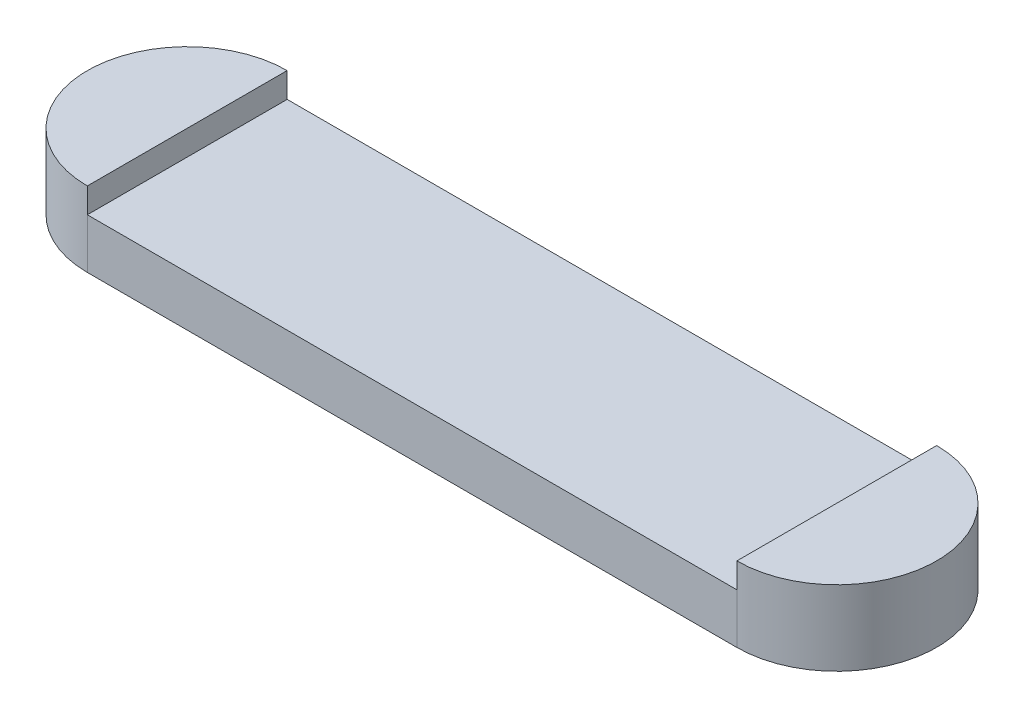
ISO-10303-21;
HEADER;
FILE_DESCRIPTION(('STEP AP214'),'2;1');
FILE_NAME('part.step','',(''),(''),'','','');
FILE_SCHEMA(('AUTOMOTIVE_DESIGN { 1 0 10303 214 1 1 1 1 }'));
ENDSEC;
DATA;
#1=APPLICATION_CONTEXT('core data for automotive mechanical design processes');
#2=APPLICATION_PROTOCOL_DEFINITION('international standard','automotive_design',2000,#1);
#3=PRODUCT_CONTEXT('',#1,'mechanical');
#4=PRODUCT('Part','Part','',(#3));
#5=PRODUCT_RELATED_PRODUCT_CATEGORY('part','',(#4));
#6=PRODUCT_DEFINITION_FORMATION('','',#4);
#7=PRODUCT_DEFINITION_CONTEXT('part definition',#1,'design');
#8=PRODUCT_DEFINITION('design','',#6,#7);
#9=PRODUCT_DEFINITION_SHAPE('','',#8);
#10=(LENGTH_UNIT() NAMED_UNIT(*) SI_UNIT(.MILLI.,.METRE.));
#11=(NAMED_UNIT(*) PLANE_ANGLE_UNIT() SI_UNIT($,.RADIAN.));
#12=(NAMED_UNIT(*) SI_UNIT($,.STERADIAN.) SOLID_ANGLE_UNIT());
#13=UNCERTAINTY_MEASURE_WITH_UNIT(LENGTH_MEASURE(1.E-05),#10,'distance_accuracy_value','');
#14=(GEOMETRIC_REPRESENTATION_CONTEXT(3) GLOBAL_UNCERTAINTY_ASSIGNED_CONTEXT((#13)) GLOBAL_UNIT_ASSIGNED_CONTEXT((#10,
#11,#12)) REPRESENTATION_CONTEXT('',''));
#15=CARTESIAN_POINT('',(0.,0.,0.));
#16=DIRECTION('',(0.,0.,1.));
#17=DIRECTION('',(1.,0.,0.));
#18=AXIS2_PLACEMENT_3D('',#15,#16,#17);
#19=CARTESIAN_POINT('',(0.,2.,0.));
#20=DIRECTION('',(0.,1.,0.));
#21=DIRECTION('',(0.,0.,1.));
#22=AXIS2_PLACEMENT_3D('',#19,#20,#21);
#23=PLANE('',#22);
#24=DIRECTION('',(1.,0.,0.));
#25=VECTOR('',#24,1.);
#26=CARTESIAN_POINT('',(0.,2.,4.));
#27=LINE('',#26,#25);
#28=CARTESIAN_POINT('',(-26.,2.,4.));
#29=VERTEX_POINT('',#28);
#30=CARTESIAN_POINT('',(0.,2.,4.));
#31=VERTEX_POINT('',#30);
#32=EDGE_CURVE('E101',#29,#31,#27,.T.);
#33=ORIENTED_EDGE('',*,*,#32,.T.);
#34=DIRECTION('',(0.,0.,1.));
#35=VECTOR('',#34,1.);
#36=CARTESIAN_POINT('',(0.,2.,-4.));
#37=LINE('',#36,#35);
#38=CARTESIAN_POINT('',(0.,2.,-4.));
#39=VERTEX_POINT('',#38);
#40=EDGE_CURVE('E134',#39,#31,#37,.T.);
#41=ORIENTED_EDGE('',*,*,#40,.F.);
#42=DIRECTION('',(-1.,0.,0.));
#43=VECTOR('',#42,1.);
#44=CARTESIAN_POINT('',(0.,2.,-4.));
#45=LINE('',#44,#43);
#46=CARTESIAN_POINT('',(-26.,2.,-4.));
#47=VERTEX_POINT('',#46);
#48=EDGE_CURVE('E90',#39,#47,#45,.T.);
#49=ORIENTED_EDGE('',*,*,#48,.T.);
#50=DIRECTION('',(0.,0.,-1.));
#51=VECTOR('',#50,1.);
#52=CARTESIAN_POINT('',(-26.,2.,-4.));
#53=LINE('',#52,#51);
#54=EDGE_CURVE('E57',#29,#47,#53,.T.);
#55=ORIENTED_EDGE('',*,*,#54,.F.);
#56=EDGE_LOOP('',(#33,#41,#49,#55));
#57=FACE_BOUND('',#56,.T.);
#58=ADVANCED_FACE('F39',(#57),#23,.T.);
#59=CARTESIAN_POINT('',(0.,2.,0.));
#60=DIRECTION('',(0.,-1.,0.));
#61=DIRECTION('',(0.,0.,-1.));
#62=AXIS2_PLACEMENT_3D('',#59,#60,#61);
#63=CYLINDRICAL_SURFACE('',#62,4.);
#64=CARTESIAN_POINT('',(0.,0.,0.));
#65=DIRECTION('',(0.,1.,0.));
#66=DIRECTION('',(0.,0.,1.));
#67=AXIS2_PLACEMENT_3D('',#64,#65,#66);
#68=CIRCLE('',#67,4.);
#69=CARTESIAN_POINT('',(0.,0.,4.));
#70=VERTEX_POINT('',#69);
#71=CARTESIAN_POINT('',(0.,0.,-4.));
#72=VERTEX_POINT('',#71);
#73=EDGE_CURVE('E96',#70,#72,#68,.T.);
#74=ORIENTED_EDGE('',*,*,#73,.T.);
#75=DIRECTION('',(0.,-1.,0.));
#76=VECTOR('',#75,1.);
#77=CARTESIAN_POINT('',(0.,2.,-4.));
#78=LINE('',#77,#76);
#79=EDGE_CURVE('E11',#39,#72,#78,.T.);
#80=ORIENTED_EDGE('',*,*,#79,.F.);
#81=DIRECTION('',(0.,-1.,0.));
#82=VECTOR('',#81,1.);
#83=CARTESIAN_POINT('',(0.,3.,-4.));
#84=LINE('',#83,#82);
#85=CARTESIAN_POINT('',(0.,3.,-4.));
#86=VERTEX_POINT('',#85);
#87=EDGE_CURVE('E142',#86,#39,#84,.T.);
#88=ORIENTED_EDGE('',*,*,#87,.F.);
#89=CARTESIAN_POINT('',(0.,3.,0.));
#90=DIRECTION('',(0.,1.,0.));
#91=DIRECTION('',(0.,0.,-1.));
#92=AXIS2_PLACEMENT_3D('',#89,#90,#91);
#93=CIRCLE('',#92,4.);
#94=CARTESIAN_POINT('',(0.,3.,4.));
#95=VERTEX_POINT('',#94);
#96=EDGE_CURVE('E172',#95,#86,#93,.T.);
#97=ORIENTED_EDGE('',*,*,#96,.F.);
#98=DIRECTION('',(0.,-1.,0.));
#99=VECTOR('',#98,1.);
#100=CARTESIAN_POINT('',(0.,3.,4.));
#101=LINE('',#100,#99);
#102=EDGE_CURVE('E99',#95,#31,#101,.T.);
#103=ORIENTED_EDGE('',*,*,#102,.T.);
#104=DIRECTION('',(0.,-1.,0.));
#105=VECTOR('',#104,1.);
#106=CARTESIAN_POINT('',(0.,2.,4.));
#107=LINE('',#106,#105);
#108=EDGE_CURVE('E85',#31,#70,#107,.T.);
#109=ORIENTED_EDGE('',*,*,#108,.T.);
#110=EDGE_LOOP('',(#74,#80,#88,#97,#103,#109));
#111=FACE_BOUND('',#110,.T.);
#112=ADVANCED_FACE('F41',(#111),#63,.T.);
#113=CARTESIAN_POINT('',(0.,2.,-4.));
#114=DIRECTION('',(0.,0.,1.));
#115=DIRECTION('',(1.,0.,0.));
#116=AXIS2_PLACEMENT_3D('',#113,#114,#115);
#117=PLANE('',#116);
#118=DIRECTION('',(-1.,0.,0.));
#119=VECTOR('',#118,1.);
#120=CARTESIAN_POINT('',(0.,0.,-4.));
#121=LINE('',#120,#119);
#122=CARTESIAN_POINT('',(-26.,0.,-4.));
#123=VERTEX_POINT('',#122);
#124=EDGE_CURVE('E104',#72,#123,#121,.T.);
#125=ORIENTED_EDGE('',*,*,#124,.T.);
#126=DIRECTION('',(0.,-1.,0.));
#127=VECTOR('',#126,1.);
#128=CARTESIAN_POINT('',(-26.,2.,-4.));
#129=LINE('',#128,#127);
#130=EDGE_CURVE('E49',#47,#123,#129,.T.);
#131=ORIENTED_EDGE('',*,*,#130,.F.);
#132=ORIENTED_EDGE('',*,*,#48,.F.);
#133=ORIENTED_EDGE('',*,*,#79,.T.);
#134=EDGE_LOOP('',(#125,#131,#132,#133));
#135=FACE_BOUND('',#134,.T.);
#136=ADVANCED_FACE('F129',(#135),#117,.F.);
#137=CARTESIAN_POINT('',(-26.,2.,0.));
#138=DIRECTION('',(0.,-1.,0.));
#139=DIRECTION('',(0.,0.,-1.));
#140=AXIS2_PLACEMENT_3D('',#137,#138,#139);
#141=CYLINDRICAL_SURFACE('',#140,4.);
#142=CARTESIAN_POINT('',(-26.,0.,0.));
#143=DIRECTION('',(0.,1.,0.));
#144=DIRECTION('',(0.,0.,1.));
#145=AXIS2_PLACEMENT_3D('',#142,#143,#144);
#146=CIRCLE('',#145,4.);
#147=CARTESIAN_POINT('',(-26.,0.,4.));
#148=VERTEX_POINT('',#147);
#149=EDGE_CURVE('E74',#123,#148,#146,.T.);
#150=ORIENTED_EDGE('',*,*,#149,.T.);
#151=DIRECTION('',(0.,-1.,0.));
#152=VECTOR('',#151,1.);
#153=CARTESIAN_POINT('',(-26.,2.,4.));
#154=LINE('',#153,#152);
#155=EDGE_CURVE('E86',#29,#148,#154,.T.);
#156=ORIENTED_EDGE('',*,*,#155,.F.);
#157=DIRECTION('',(0.,-1.,0.));
#158=VECTOR('',#157,1.);
#159=CARTESIAN_POINT('',(-26.,3.,4.));
#160=LINE('',#159,#158);
#161=CARTESIAN_POINT('',(-26.,3.,4.));
#162=VERTEX_POINT('',#161);
#163=EDGE_CURVE('E106',#162,#29,#160,.T.);
#164=ORIENTED_EDGE('',*,*,#163,.F.);
#165=CARTESIAN_POINT('',(-26.,3.,0.));
#166=DIRECTION('',(0.,1.,0.));
#167=DIRECTION('',(0.,0.,1.));
#168=AXIS2_PLACEMENT_3D('',#165,#166,#167);
#169=CIRCLE('',#168,3.99999999999999);
#170=CARTESIAN_POINT('',(-26.,3.,-4.));
#171=VERTEX_POINT('',#170);
#172=EDGE_CURVE('E141',#171,#162,#169,.T.);
#173=ORIENTED_EDGE('',*,*,#172,.F.);
#174=DIRECTION('',(0.,-1.,0.));
#175=VECTOR('',#174,1.);
#176=CARTESIAN_POINT('',(-26.,3.,-4.));
#177=LINE('',#176,#175);
#178=EDGE_CURVE('E112',#171,#47,#177,.T.);
#179=ORIENTED_EDGE('',*,*,#178,.T.);
#180=ORIENTED_EDGE('',*,*,#130,.T.);
#181=EDGE_LOOP('',(#150,#156,#164,#173,#179,#180));
#182=FACE_BOUND('',#181,.T.);
#183=ADVANCED_FACE('F123',(#182),#141,.T.);
#184=CARTESIAN_POINT('',(0.,2.,4.));
#185=DIRECTION('',(0.,0.,-1.));
#186=DIRECTION('',(-1.,0.,0.));
#187=AXIS2_PLACEMENT_3D('',#184,#185,#186);
#188=PLANE('',#187);
#189=DIRECTION('',(1.,0.,0.));
#190=VECTOR('',#189,1.);
#191=CARTESIAN_POINT('',(0.,0.,4.));
#192=LINE('',#191,#190);
#193=EDGE_CURVE('E80',#148,#70,#192,.T.);
#194=ORIENTED_EDGE('',*,*,#193,.T.);
#195=ORIENTED_EDGE('',*,*,#108,.F.);
#196=ORIENTED_EDGE('',*,*,#32,.F.);
#197=ORIENTED_EDGE('',*,*,#155,.T.);
#198=EDGE_LOOP('',(#194,#195,#196,#197));
#199=FACE_BOUND('',#198,.T.);
#200=ADVANCED_FACE('F82',(#199),#188,.F.);
#201=CARTESIAN_POINT('',(0.,0.,0.));
#202=DIRECTION('',(0.,1.,0.));
#203=DIRECTION('',(0.,0.,1.));
#204=AXIS2_PLACEMENT_3D('',#201,#202,#203);
#205=PLANE('',#204);
#206=ORIENTED_EDGE('',*,*,#73,.F.);
#207=ORIENTED_EDGE('',*,*,#193,.F.);
#208=ORIENTED_EDGE('',*,*,#149,.F.);
#209=ORIENTED_EDGE('',*,*,#124,.F.);
#210=EDGE_LOOP('',(#206,#207,#208,#209));
#211=FACE_BOUND('',#210,.T.);
#212=ADVANCED_FACE('F103',(#211),#205,.F.);
#213=CARTESIAN_POINT('',(-26.,3.,-4.));
#214=DIRECTION('',(-1.,0.,0.));
#215=DIRECTION('',(0.,0.,1.));
#216=AXIS2_PLACEMENT_3D('',#213,#214,#215);
#217=PLANE('',#216);
#218=ORIENTED_EDGE('',*,*,#54,.T.);
#219=ORIENTED_EDGE('',*,*,#178,.F.);
#220=DIRECTION('',(0.,0.,-1.));
#221=VECTOR('',#220,1.);
#222=CARTESIAN_POINT('',(-26.,3.,-4.));
#223=LINE('',#222,#221);
#224=EDGE_CURVE('E147',#162,#171,#223,.T.);
#225=ORIENTED_EDGE('',*,*,#224,.F.);
#226=ORIENTED_EDGE('',*,*,#163,.T.);
#227=EDGE_LOOP('',(#218,#219,#225,#226));
#228=FACE_BOUND('',#227,.T.);
#229=ADVANCED_FACE('F137',(#228),#217,.F.);
#230=CARTESIAN_POINT('',(-26.,3.,0.));
#231=DIRECTION('',(0.,1.,0.));
#232=DIRECTION('',(0.,0.,1.));
#233=AXIS2_PLACEMENT_3D('',#230,#231,#232);
#234=PLANE('',#233);
#235=ORIENTED_EDGE('',*,*,#172,.T.);
#236=ORIENTED_EDGE('',*,*,#224,.T.);
#237=EDGE_LOOP('',(#235,#236));
#238=FACE_BOUND('',#237,.T.);
#239=ADVANCED_FACE('F156',(#238),#234,.T.);
#240=CARTESIAN_POINT('',(0.,3.,-4.));
#241=DIRECTION('',(1.,0.,0.));
#242=DIRECTION('',(0.,0.,-1.));
#243=AXIS2_PLACEMENT_3D('',#240,#241,#242);
#244=PLANE('',#243);
#245=ORIENTED_EDGE('',*,*,#40,.T.);
#246=ORIENTED_EDGE('',*,*,#102,.F.);
#247=DIRECTION('',(0.,0.,1.));
#248=VECTOR('',#247,1.);
#249=CARTESIAN_POINT('',(0.,3.,-4.));
#250=LINE('',#249,#248);
#251=EDGE_CURVE('E166',#86,#95,#250,.T.);
#252=ORIENTED_EDGE('',*,*,#251,.F.);
#253=ORIENTED_EDGE('',*,*,#87,.T.);
#254=EDGE_LOOP('',(#245,#246,#252,#253));
#255=FACE_BOUND('',#254,.T.);
#256=ADVANCED_FACE('F168',(#255),#244,.F.);
#257=CARTESIAN_POINT('',(0.,3.,0.));
#258=DIRECTION('',(0.,-1.,0.));
#259=DIRECTION('',(0.,0.,-1.));
#260=AXIS2_PLACEMENT_3D('',#257,#258,#259);
#261=PLANE('',#260);
#262=ORIENTED_EDGE('',*,*,#96,.T.);
#263=ORIENTED_EDGE('',*,*,#251,.T.);
#264=EDGE_LOOP('',(#262,#263));
#265=FACE_BOUND('',#264,.T.);
#266=ADVANCED_FACE('F174',(#265),#261,.F.);
#267=CLOSED_SHELL('',(#58,#112,#136,#183,#200,#212,#229,#239,#256,#266));
#268=MANIFOLD_SOLID_BREP('B2',#267);
#269=ADVANCED_BREP_SHAPE_REPRESENTATION('',(#18,#268),#14);
#270=SHAPE_DEFINITION_REPRESENTATION(#9,#269);
ENDSEC;
END-ISO-10303-21;
